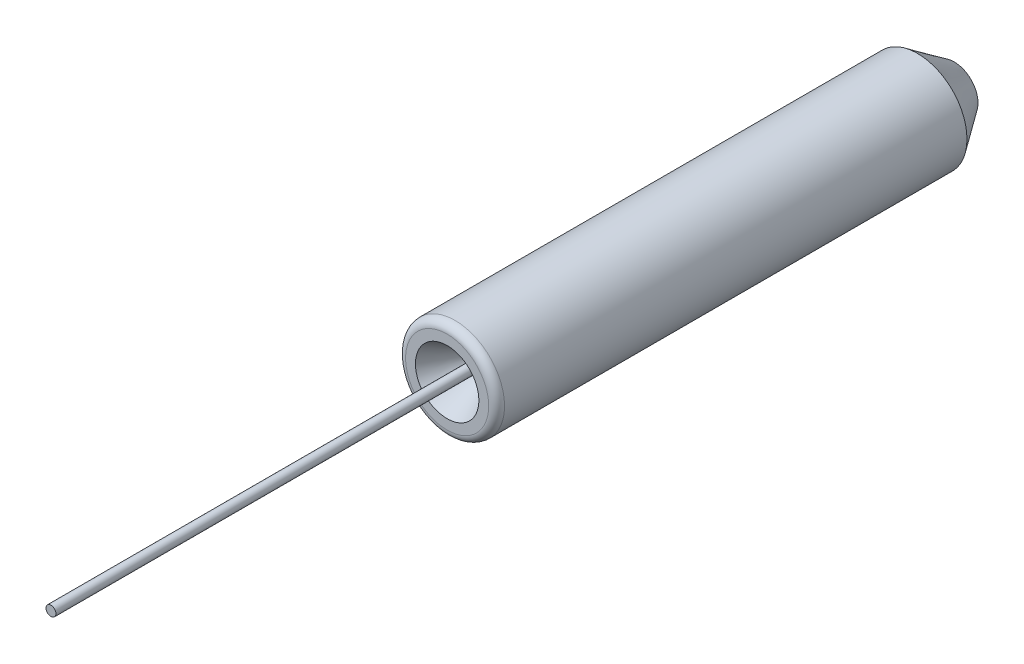
ISO-10303-21;
HEADER;
FILE_DESCRIPTION(('STEP AP214'),'2;1');
FILE_NAME('part.step','',(''),(''),'','','');
FILE_SCHEMA(('AUTOMOTIVE_DESIGN { 1 0 10303 214 1 1 1 1 }'));
ENDSEC;
DATA;
#1=APPLICATION_CONTEXT('core data for automotive mechanical design processes');
#2=APPLICATION_PROTOCOL_DEFINITION('international standard','automotive_design',2000,#1);
#3=PRODUCT_CONTEXT('',#1,'mechanical');
#4=PRODUCT('Part','Part','',(#3));
#5=PRODUCT_RELATED_PRODUCT_CATEGORY('part','',(#4));
#6=PRODUCT_DEFINITION_FORMATION('','',#4);
#7=PRODUCT_DEFINITION_CONTEXT('part definition',#1,'design');
#8=PRODUCT_DEFINITION('design','',#6,#7);
#9=PRODUCT_DEFINITION_SHAPE('','',#8);
#10=(LENGTH_UNIT() NAMED_UNIT(*) SI_UNIT(.MILLI.,.METRE.));
#11=(NAMED_UNIT(*) PLANE_ANGLE_UNIT() SI_UNIT($,.RADIAN.));
#12=(NAMED_UNIT(*) SI_UNIT($,.STERADIAN.) SOLID_ANGLE_UNIT());
#13=UNCERTAINTY_MEASURE_WITH_UNIT(LENGTH_MEASURE(1.E-05),#10,'distance_accuracy_value','');
#14=(GEOMETRIC_REPRESENTATION_CONTEXT(3) GLOBAL_UNCERTAINTY_ASSIGNED_CONTEXT((#13)) GLOBAL_UNIT_ASSIGNED_CONTEXT((#10,
#11,#12)) REPRESENTATION_CONTEXT('',''));
#15=CARTESIAN_POINT('',(0.,0.,0.));
#16=DIRECTION('',(0.,0.,1.));
#17=DIRECTION('',(1.,0.,0.));
#18=AXIS2_PLACEMENT_3D('',#15,#16,#17);
#19=CARTESIAN_POINT('',(0.,0.,-6.4));
#20=DIRECTION('',(0.,0.,1.));
#21=DIRECTION('',(1.,0.,0.));
#22=AXIS2_PLACEMENT_3D('',#19,#20,#21);
#23=CYLINDRICAL_SURFACE('',#22,0.0625);
#24=CARTESIAN_POINT('',(0.,0.,-6.4));
#25=DIRECTION('',(0.,0.,1.));
#26=DIRECTION('',(1.,0.,0.));
#27=AXIS2_PLACEMENT_3D('',#24,#25,#26);
#28=CIRCLE('',#27,0.0625);
#29=CARTESIAN_POINT('',(0.0625,0.,-6.4));
#30=VERTEX_POINT('',#29);
#31=EDGE_CURVE('P0_E10',#30,#30,#28,.T.);
#32=ORIENTED_EDGE('',*,*,#31,.T.);
#33=EDGE_LOOP('',(#32));
#34=FACE_BOUND('',#33,.T.);
#35=CARTESIAN_POINT('',(0.,0.,5.));
#36=DIRECTION('',(0.,0.,1.));
#37=DIRECTION('',(1.,0.,0.));
#38=AXIS2_PLACEMENT_3D('',#35,#36,#37);
#39=CIRCLE('',#38,0.0625);
#40=CARTESIAN_POINT('',(0.0625,0.,5.));
#41=VERTEX_POINT('',#40);
#42=EDGE_CURVE('P0_E17',#41,#41,#39,.T.);
#43=ORIENTED_EDGE('',*,*,#42,.F.);
#44=EDGE_LOOP('',(#43));
#45=FACE_BOUND('',#44,.T.);
#46=ADVANCED_FACE('P0_F14',(#34,#45),#23,.T.);
#47=CARTESIAN_POINT('',(0.,0.,-6.4));
#48=DIRECTION('',(0.,0.,1.));
#49=DIRECTION('',(1.,0.,0.));
#50=AXIS2_PLACEMENT_3D('',#47,#48,#49);
#51=PLANE('',#50);
#52=ORIENTED_EDGE('',*,*,#31,.F.);
#53=EDGE_LOOP('',(#52));
#54=FACE_BOUND('',#53,.T.);
#55=ADVANCED_FACE('P0_F29',(#54),#51,.F.);
#56=CARTESIAN_POINT('',(0.,0.,5.));
#57=DIRECTION('',(0.,0.,1.));
#58=DIRECTION('',(1.,0.,0.));
#59=AXIS2_PLACEMENT_3D('',#56,#57,#58);
#60=PLANE('',#59);
#61=ORIENTED_EDGE('',*,*,#42,.T.);
#62=EDGE_LOOP('',(#61));
#63=FACE_BOUND('',#62,.T.);
#64=ADVANCED_FACE('P0_F26',(#63),#60,.T.);
#65=CLOSED_SHELL('',(#46,#55,#64));
#66=MANIFOLD_SOLID_BREP('P0_B1',#65);
#67=CARTESIAN_POINT('',(0.,0.,-6.4));
#68=DIRECTION('',(0.,0.,1.));
#69=DIRECTION('',(1.,0.,0.));
#70=AXIS2_PLACEMENT_3D('',#67,#68,#69);
#71=CYLINDRICAL_SURFACE('',#70,0.6245);
#72=CARTESIAN_POINT('',(0.,0.,-0.1));
#73=DIRECTION('',(0.,0.,1.));
#74=DIRECTION('',(1.,0.,0.));
#75=AXIS2_PLACEMENT_3D('',#72,#73,#74);
#76=CIRCLE('',#75,0.6245);
#77=CARTESIAN_POINT('',(0.6245,0.,-0.1));
#78=VERTEX_POINT('',#77);
#79=EDGE_CURVE('P1_E9',#78,#78,#76,.F.);
#80=ORIENTED_EDGE('',*,*,#79,.T.);
#81=EDGE_LOOP('',(#80));
#82=FACE_BOUND('',#81,.T.);
#83=CARTESIAN_POINT('',(0.,0.,-5.93585189780881));
#84=DIRECTION('',(0.,0.,1.));
#85=DIRECTION('',(1.,0.,0.));
#86=AXIS2_PLACEMENT_3D('',#83,#84,#85);
#87=CIRCLE('',#86,0.6245);
#88=CARTESIAN_POINT('',(0.6245,0.,-5.93585189780881));
#89=VERTEX_POINT('',#88);
#90=EDGE_CURVE('P1_E28',#89,#89,#87,.T.);
#91=ORIENTED_EDGE('',*,*,#90,.T.);
#92=EDGE_LOOP('',(#91));
#93=FACE_BOUND('',#92,.T.);
#94=ADVANCED_FACE('P1_F13',(#82,#93),#71,.T.);
#95=CARTESIAN_POINT('',(0.,0.,-6.4));
#96=DIRECTION('',(0.,0.,1.));
#97=DIRECTION('',(1.,0.,0.));
#98=AXIS2_PLACEMENT_3D('',#95,#96,#97);
#99=PLANE('',#98);
#100=CARTESIAN_POINT('',(0.,0.,-6.4));
#101=DIRECTION('',(0.,0.,1.));
#102=DIRECTION('',(1.,0.,0.));
#103=AXIS2_PLACEMENT_3D('',#100,#101,#102);
#104=CIRCLE('',#103,0.299499999999999);
#105=CARTESIAN_POINT('',(0.299499999999999,0.,-6.4));
#106=VERTEX_POINT('',#105);
#107=EDGE_CURVE('P1_E24',#106,#106,#104,.F.);
#108=ORIENTED_EDGE('',*,*,#107,.T.);
#109=EDGE_LOOP('',(#108));
#110=FACE_BOUND('',#109,.T.);
#111=CARTESIAN_POINT('',(0.,0.,-6.4));
#112=DIRECTION('',(0.,0.,-1.));
#113=DIRECTION('',(-1.,0.,0.));
#114=AXIS2_PLACEMENT_3D('',#111,#112,#113);
#115=CIRCLE('',#114,0.063);
#116=CARTESIAN_POINT('',(-0.063,0.,-6.4));
#117=VERTEX_POINT('',#116);
#118=EDGE_CURVE('P1_E42',#117,#117,#115,.T.);
#119=ORIENTED_EDGE('',*,*,#118,.F.);
#120=EDGE_LOOP('',(#119));
#121=FACE_BOUND('',#120,.T.);
#122=ADVANCED_FACE('P1_F48',(#110,#121),#99,.F.);
#123=CARTESIAN_POINT('',(0.,0.,0.));
#124=DIRECTION('',(0.,0.,1.));
#125=DIRECTION('',(1.,0.,0.));
#126=AXIS2_PLACEMENT_3D('',#123,#124,#125);
#127=PLANE('',#126);
#128=CARTESIAN_POINT('',(0.,0.,0.));
#129=DIRECTION('',(0.,0.,1.));
#130=DIRECTION('',(1.,0.,0.));
#131=AXIS2_PLACEMENT_3D('',#128,#129,#130);
#132=CIRCLE('',#131,0.5245);
#133=CARTESIAN_POINT('',(0.5245,0.,0.));
#134=VERTEX_POINT('',#133);
#135=EDGE_CURVE('P1_E20',#134,#134,#132,.T.);
#136=ORIENTED_EDGE('',*,*,#135,.T.);
#137=EDGE_LOOP('',(#136));
#138=FACE_BOUND('',#137,.T.);
#139=CARTESIAN_POINT('',(0.,0.,0.));
#140=DIRECTION('',(0.,0.,-1.));
#141=DIRECTION('',(-1.,0.,0.));
#142=AXIS2_PLACEMENT_3D('',#139,#140,#141);
#143=CIRCLE('',#142,0.4);
#144=CARTESIAN_POINT('',(-0.4,0.,0.));
#145=VERTEX_POINT('',#144);
#146=EDGE_CURVE('P1_E33',#145,#145,#143,.T.);
#147=ORIENTED_EDGE('',*,*,#146,.T.);
#148=EDGE_LOOP('',(#147));
#149=FACE_BOUND('',#148,.T.);
#150=ADVANCED_FACE('P1_F50',(#138,#149),#127,.T.);
#151=CARTESIAN_POINT('',(0.,0.,-0.537290960636936));
#152=DIRECTION('',(0.,0.,1.));
#153=DIRECTION('',(1.,0.,0.));
#154=AXIS2_PLACEMENT_3D('',#151,#152,#153);
#155=CONICAL_SURFACE('',#154,0.0897949192431117,0.5235987755983);
#156=ORIENTED_EDGE('',*,*,#146,.F.);
#157=EDGE_LOOP('',(#156));
#158=FACE_BOUND('',#157,.T.);
#159=CARTESIAN_POINT('',(0.,0.,-0.537290960636936));
#160=DIRECTION('',(0.,0.,-1.));
#161=DIRECTION('',(-1.,0.,0.));
#162=AXIS2_PLACEMENT_3D('',#159,#160,#161);
#163=CIRCLE('',#162,0.0897949192431117);
#164=CARTESIAN_POINT('',(-0.0897949192431117,0.,-0.537290960636936));
#165=VERTEX_POINT('',#164);
#166=EDGE_CURVE('P1_E36',#165,#165,#163,.T.);
#167=ORIENTED_EDGE('',*,*,#166,.T.);
#168=EDGE_LOOP('',(#167));
#169=FACE_BOUND('',#168,.T.);
#170=ADVANCED_FACE('P1_F58',(#158,#169),#155,.F.);
#171=CARTESIAN_POINT('',(0.,0.,-0.637290960636936));
#172=DIRECTION('',(0.,0.,-1.));
#173=DIRECTION('',(-1.,0.,0.));
#174=AXIS2_PLACEMENT_3D('',#171,#172,#173);
#175=TOROIDAL_SURFACE('',#174,0.262999999999999,0.2);
#176=ORIENTED_EDGE('',*,*,#166,.F.);
#177=EDGE_LOOP('',(#176));
#178=FACE_BOUND('',#177,.T.);
#179=CARTESIAN_POINT('',(0.,0.,-0.637290960636937));
#180=DIRECTION('',(0.,0.,-1.));
#181=DIRECTION('',(-1.,0.,0.));
#182=AXIS2_PLACEMENT_3D('',#179,#180,#181);
#183=CIRCLE('',#182,0.0629999999999993);
#184=CARTESIAN_POINT('',(-0.0629999999999993,0.,-0.637290960636937));
#185=VERTEX_POINT('',#184);
#186=EDGE_CURVE('P1_E39',#185,#185,#183,.T.);
#187=ORIENTED_EDGE('',*,*,#186,.T.);
#188=EDGE_LOOP('',(#187));
#189=FACE_BOUND('',#188,.T.);
#190=ADVANCED_FACE('P1_F71',(#178,#189),#175,.T.);
#191=CARTESIAN_POINT('',(0.,0.,-13.136975719544));
#192=DIRECTION('',(0.,0.,-1.));
#193=DIRECTION('',(-1.,0.,0.));
#194=AXIS2_PLACEMENT_3D('',#191,#192,#193);
#195=CYLINDRICAL_SURFACE('',#194,0.0629999999999997);
#196=ORIENTED_EDGE('',*,*,#186,.F.);
#197=EDGE_LOOP('',(#196));
#198=FACE_BOUND('',#197,.T.);
#199=ORIENTED_EDGE('',*,*,#118,.T.);
#200=EDGE_LOOP('',(#199));
#201=FACE_BOUND('',#200,.T.);
#202=ADVANCED_FACE('P1_F46',(#198,#201),#195,.F.);
#203=CARTESIAN_POINT('',(0.,0.,-5.93585189780881));
#204=DIRECTION('',(0.,0.,1.));
#205=DIRECTION('',(1.,0.,0.));
#206=AXIS2_PLACEMENT_3D('',#203,#204,#205);
#207=CONICAL_SURFACE('',#206,0.6245,0.610865238198017);
#208=ORIENTED_EDGE('',*,*,#107,.F.);
#209=EDGE_LOOP('',(#208));
#210=FACE_BOUND('',#209,.T.);
#211=ORIENTED_EDGE('',*,*,#90,.F.);
#212=EDGE_LOOP('',(#211));
#213=FACE_BOUND('',#212,.T.);
#214=ADVANCED_FACE('P1_F63',(#210,#213),#207,.T.);
#215=CARTESIAN_POINT('',(0.,0.,-0.1));
#216=DIRECTION('',(0.,0.,1.));
#217=DIRECTION('',(1.,0.,0.));
#218=AXIS2_PLACEMENT_3D('',#215,#216,#217);
#219=TOROIDAL_SURFACE('',#218,0.5245,0.1);
#220=ORIENTED_EDGE('',*,*,#79,.F.);
#221=EDGE_LOOP('',(#220));
#222=FACE_BOUND('',#221,.T.);
#223=ORIENTED_EDGE('',*,*,#135,.F.);
#224=EDGE_LOOP('',(#223));
#225=FACE_BOUND('',#224,.T.);
#226=ADVANCED_FACE('P1_F15',(#222,#225),#219,.T.);
#227=CLOSED_SHELL('',(#94,#122,#150,#170,#190,#202,#214,#226));
#228=MANIFOLD_SOLID_BREP('P1_B1',#227);
#229=ADVANCED_BREP_SHAPE_REPRESENTATION('',(#18,#66,#228),#14);
#230=SHAPE_DEFINITION_REPRESENTATION(#9,#229);
ENDSEC;
END-ISO-10303-21;
